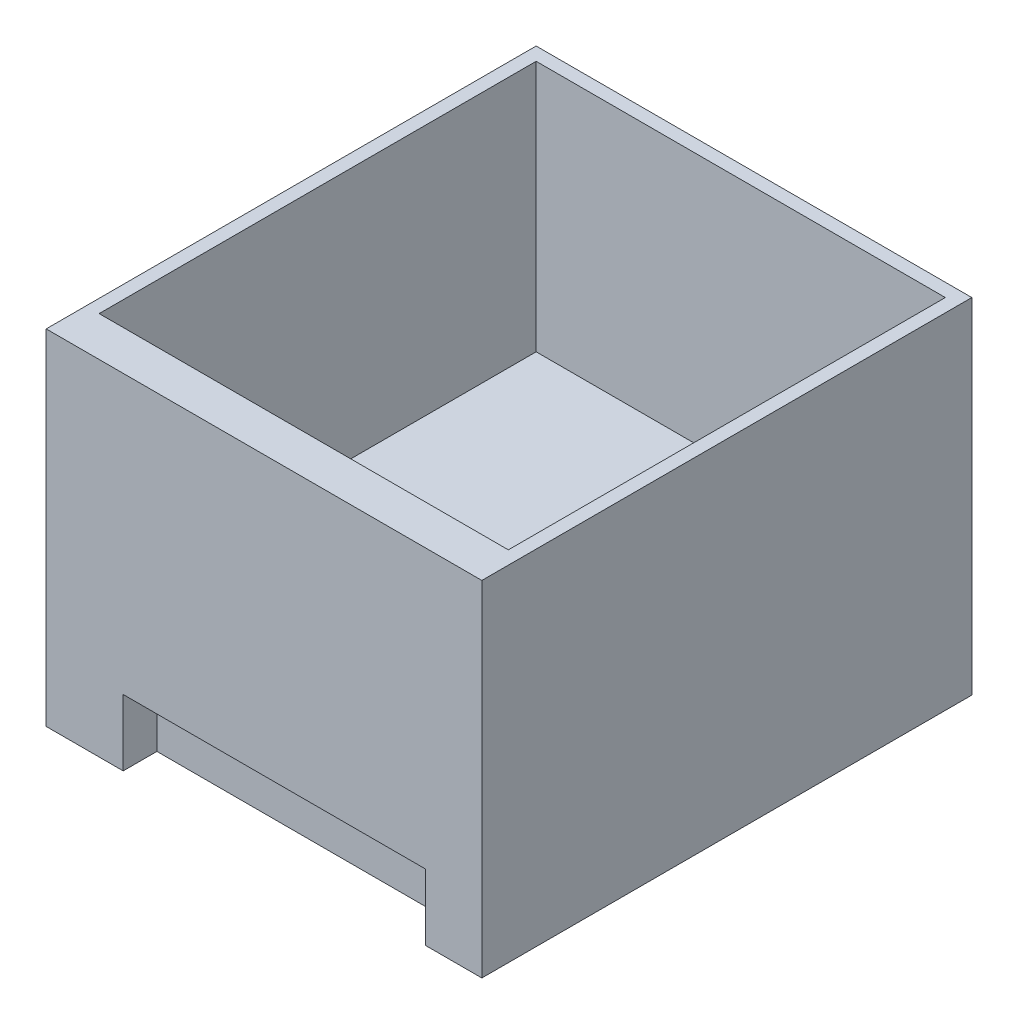
ISO-10303-21;
HEADER;
FILE_DESCRIPTION(('STEP AP214'),'2;1');
FILE_NAME('part.step','',(''),(''),'','','');
FILE_SCHEMA(('AUTOMOTIVE_DESIGN { 1 0 10303 214 1 1 1 1 }'));
ENDSEC;
DATA;
#1=APPLICATION_CONTEXT('core data for automotive mechanical design processes');
#2=APPLICATION_PROTOCOL_DEFINITION('international standard','automotive_design',2000,#1);
#3=PRODUCT_CONTEXT('',#1,'mechanical');
#4=PRODUCT('Part','Part','',(#3));
#5=PRODUCT_RELATED_PRODUCT_CATEGORY('part','',(#4));
#6=PRODUCT_DEFINITION_FORMATION('','',#4);
#7=PRODUCT_DEFINITION_CONTEXT('part definition',#1,'design');
#8=PRODUCT_DEFINITION('design','',#6,#7);
#9=PRODUCT_DEFINITION_SHAPE('','',#8);
#10=(LENGTH_UNIT() NAMED_UNIT(*) SI_UNIT(.MILLI.,.METRE.));
#11=(NAMED_UNIT(*) PLANE_ANGLE_UNIT() SI_UNIT($,.RADIAN.));
#12=(NAMED_UNIT(*) SI_UNIT($,.STERADIAN.) SOLID_ANGLE_UNIT());
#13=UNCERTAINTY_MEASURE_WITH_UNIT(LENGTH_MEASURE(1.E-05),#10,'distance_accuracy_value','');
#14=(GEOMETRIC_REPRESENTATION_CONTEXT(3) GLOBAL_UNCERTAINTY_ASSIGNED_CONTEXT((#13)) GLOBAL_UNIT_ASSIGNED_CONTEXT((#10,
#11,#12)) REPRESENTATION_CONTEXT('',''));
#15=CARTESIAN_POINT('',(0.,0.,0.));
#16=DIRECTION('',(0.,0.,1.));
#17=DIRECTION('',(1.,0.,0.));
#18=AXIS2_PLACEMENT_3D('',#15,#16,#17);
#19=CARTESIAN_POINT('',(-98.771737374825,47.4800796812749,-370.));
#20=DIRECTION('',(-1.,0.,0.));
#21=DIRECTION('',(0.,-1.,0.));
#22=AXIS2_PLACEMENT_3D('',#19,#20,#21);
#23=PLANE('',#22);
#24=DIRECTION('',(0.,-1.,0.));
#25=VECTOR('',#24,1.);
#26=CARTESIAN_POINT('',(-98.771737374825,47.4800796812749,0.));
#27=LINE('',#26,#25);
#28=CARTESIAN_POINT('',(-98.771737374825,47.4800796812749,0.));
#29=VERTEX_POINT('',#28);
#30=CARTESIAN_POINT('',(-98.771737374825,-212.519920318725,0.));
#31=VERTEX_POINT('',#30);
#32=EDGE_CURVE('E186',#29,#31,#27,.T.);
#33=ORIENTED_EDGE('',*,*,#32,.F.);
#34=DIRECTION('',(0.,0.,1.));
#35=VECTOR('',#34,1.);
#36=CARTESIAN_POINT('',(-98.771737374825,47.4800796812749,-370.));
#37=LINE('',#36,#35);
#38=CARTESIAN_POINT('',(-98.771737374825,47.4800796812749,-370.));
#39=VERTEX_POINT('',#38);
#40=EDGE_CURVE('E11',#39,#29,#37,.T.);
#41=ORIENTED_EDGE('',*,*,#40,.F.);
#42=DIRECTION('',(0.,-1.,0.));
#43=VECTOR('',#42,1.);
#44=CARTESIAN_POINT('',(-98.771737374825,47.4800796812749,-370.));
#45=LINE('',#44,#43);
#46=CARTESIAN_POINT('',(-98.771737374825,-212.519920318725,-370.));
#47=VERTEX_POINT('',#46);
#48=EDGE_CURVE('E192',#39,#47,#45,.T.);
#49=ORIENTED_EDGE('',*,*,#48,.T.);
#50=DIRECTION('',(0.,0.,1.));
#51=VECTOR('',#50,1.);
#52=CARTESIAN_POINT('',(-98.771737374825,-212.519920318725,-370.));
#53=LINE('',#52,#51);
#54=EDGE_CURVE('E40',#47,#31,#53,.T.);
#55=ORIENTED_EDGE('',*,*,#54,.T.);
#56=EDGE_LOOP('',(#33,#41,#49,#55));
#57=FACE_BOUND('',#56,.T.);
#58=ADVANCED_FACE('F37',(#57),#23,.T.);
#59=CARTESIAN_POINT('',(-98.771737374825,47.4800796812749,-370.));
#60=DIRECTION('',(0.,1.,0.));
#61=DIRECTION('',(0.,0.,1.));
#62=AXIS2_PLACEMENT_3D('',#59,#60,#61);
#63=PLANE('',#62);
#64=DIRECTION('',(0.,0.,-1.));
#65=VECTOR('',#64,1.);
#66=CARTESIAN_POINT('',(220.228262625175,47.4800796812749,-30.));
#67=LINE('',#66,#65);
#68=CARTESIAN_POINT('',(220.228262625175,47.4800796812749,-30.));
#69=VERTEX_POINT('',#68);
#70=CARTESIAN_POINT('',(220.228262625175,47.4800796812749,-360.));
#71=VERTEX_POINT('',#70);
#72=EDGE_CURVE('E61',#69,#71,#67,.T.);
#73=ORIENTED_EDGE('',*,*,#72,.F.);
#74=DIRECTION('',(1.,0.,0.));
#75=VECTOR('',#74,1.);
#76=CARTESIAN_POINT('',(220.228262625175,47.4800796812749,-30.));
#77=LINE('',#76,#75);
#78=CARTESIAN_POINT('',(-88.771737374825,47.4800796812749,-30.));
#79=VERTEX_POINT('',#78);
#80=EDGE_CURVE('E165',#79,#69,#77,.T.);
#81=ORIENTED_EDGE('',*,*,#80,.F.);
#82=DIRECTION('',(0.,0.,1.));
#83=VECTOR('',#82,1.);
#84=CARTESIAN_POINT('',(-88.771737374825,47.4800796812749,-30.));
#85=LINE('',#84,#83);
#86=CARTESIAN_POINT('',(-88.771737374825,47.4800796812749,-360.));
#87=VERTEX_POINT('',#86);
#88=EDGE_CURVE('E179',#87,#79,#85,.T.);
#89=ORIENTED_EDGE('',*,*,#88,.F.);
#90=DIRECTION('',(-1.,0.,0.));
#91=VECTOR('',#90,1.);
#92=CARTESIAN_POINT('',(220.228262625175,47.4800796812749,-360.));
#93=LINE('',#92,#91);
#94=EDGE_CURVE('E176',#71,#87,#93,.T.);
#95=ORIENTED_EDGE('',*,*,#94,.F.);
#96=EDGE_LOOP('',(#73,#81,#89,#95));
#97=FACE_BOUND('',#96,.T.);
#98=DIRECTION('',(-1.,0.,0.));
#99=VECTOR('',#98,1.);
#100=CARTESIAN_POINT('',(-98.771737374825,47.4800796812749,0.));
#101=LINE('',#100,#99);
#102=CARTESIAN_POINT('',(230.228262625175,47.4800796812749,0.));
#103=VERTEX_POINT('',#102);
#104=EDGE_CURVE('E196',#103,#29,#101,.T.);
#105=ORIENTED_EDGE('',*,*,#104,.F.);
#106=DIRECTION('',(0.,0.,1.));
#107=VECTOR('',#106,1.);
#108=CARTESIAN_POINT('',(230.228262625175,47.4800796812749,-370.));
#109=LINE('',#108,#107);
#110=CARTESIAN_POINT('',(230.228262625175,47.4800796812749,-370.));
#111=VERTEX_POINT('',#110);
#112=EDGE_CURVE('E45',#111,#103,#109,.T.);
#113=ORIENTED_EDGE('',*,*,#112,.F.);
#114=DIRECTION('',(-1.,0.,0.));
#115=VECTOR('',#114,1.);
#116=CARTESIAN_POINT('',(-98.771737374825,47.4800796812749,-370.));
#117=LINE('',#116,#115);
#118=EDGE_CURVE('E202',#111,#39,#117,.T.);
#119=ORIENTED_EDGE('',*,*,#118,.T.);
#120=ORIENTED_EDGE('',*,*,#40,.T.);
#121=EDGE_LOOP('',(#105,#113,#119,#120));
#122=FACE_BOUND('',#121,.T.);
#123=ADVANCED_FACE('F231',(#97,#122),#63,.T.);
#124=CARTESIAN_POINT('',(230.228262625175,47.4800796812749,-370.));
#125=DIRECTION('',(1.,0.,0.));
#126=DIRECTION('',(0.,1.,0.));
#127=AXIS2_PLACEMENT_3D('',#124,#125,#126);
#128=PLANE('',#127);
#129=DIRECTION('',(0.,1.,0.));
#130=VECTOR('',#129,1.);
#131=CARTESIAN_POINT('',(230.228262625175,47.4800796812749,0.));
#132=LINE('',#131,#130);
#133=CARTESIAN_POINT('',(230.228262625175,-212.519920318725,0.));
#134=VERTEX_POINT('',#133);
#135=EDGE_CURVE('E211',#134,#103,#132,.T.);
#136=ORIENTED_EDGE('',*,*,#135,.F.);
#137=DIRECTION('',(0.,0.,1.));
#138=VECTOR('',#137,1.);
#139=CARTESIAN_POINT('',(230.228262625175,-212.519920318725,-370.));
#140=LINE('',#139,#138);
#141=CARTESIAN_POINT('',(230.228262625175,-212.519920318725,-370.));
#142=VERTEX_POINT('',#141);
#143=EDGE_CURVE('E216',#142,#134,#140,.T.);
#144=ORIENTED_EDGE('',*,*,#143,.F.);
#145=DIRECTION('',(0.,1.,0.));
#146=VECTOR('',#145,1.);
#147=CARTESIAN_POINT('',(230.228262625175,47.4800796812749,-370.));
#148=LINE('',#147,#146);
#149=EDGE_CURVE('E199',#142,#111,#148,.T.);
#150=ORIENTED_EDGE('',*,*,#149,.T.);
#151=ORIENTED_EDGE('',*,*,#112,.T.);
#152=EDGE_LOOP('',(#136,#144,#150,#151));
#153=FACE_BOUND('',#152,.T.);
#154=ADVANCED_FACE('F237',(#153),#128,.T.);
#155=CARTESIAN_POINT('',(-98.771737374825,-212.519920318725,-370.));
#156=DIRECTION('',(0.,-1.,0.));
#157=DIRECTION('',(0.,0.,-1.));
#158=AXIS2_PLACEMENT_3D('',#155,#156,#157);
#159=PLANE('',#158);
#160=DIRECTION('',(0.,0.,-1.));
#161=VECTOR('',#160,1.);
#162=CARTESIAN_POINT('',(-40.6244894461179,-212.519920318725,0.));
#163=LINE('',#162,#161);
#164=CARTESIAN_POINT('',(-40.6244894461179,-212.519920318725,0.));
#165=VERTEX_POINT('',#164);
#166=CARTESIAN_POINT('',(-40.6244894461179,-212.519920318725,-25.4708718930602));
#167=VERTEX_POINT('',#166);
#168=EDGE_CURVE('E133',#165,#167,#163,.T.);
#169=ORIENTED_EDGE('',*,*,#168,.F.);
#170=DIRECTION('',(1.,0.,0.));
#171=VECTOR('',#170,1.);
#172=CARTESIAN_POINT('',(-98.771737374825,-212.519920318725,0.));
#173=LINE('',#172,#171);
#174=EDGE_CURVE('E208',#31,#165,#173,.T.);
#175=ORIENTED_EDGE('',*,*,#174,.F.);
#176=ORIENTED_EDGE('',*,*,#54,.F.);
#177=DIRECTION('',(1.,0.,0.));
#178=VECTOR('',#177,1.);
#179=CARTESIAN_POINT('',(-98.771737374825,-212.519920318725,-370.));
#180=LINE('',#179,#178);
#181=EDGE_CURVE('E195',#47,#142,#180,.T.);
#182=ORIENTED_EDGE('',*,*,#181,.T.);
#183=ORIENTED_EDGE('',*,*,#143,.T.);
#184=CARTESIAN_POINT('',(187.855824812306,-212.519920318725,0.));
#185=VERTEX_POINT('',#184);
#186=EDGE_CURVE('E207',#185,#134,#173,.T.);
#187=ORIENTED_EDGE('',*,*,#186,.F.);
#188=DIRECTION('',(0.,0.,1.));
#189=VECTOR('',#188,1.);
#190=CARTESIAN_POINT('',(187.855824812306,-212.519920318725,0.));
#191=LINE('',#190,#189);
#192=CARTESIAN_POINT('',(187.855824812306,-212.519920318725,-25.4708718930602));
#193=VERTEX_POINT('',#192);
#194=EDGE_CURVE('E146',#193,#185,#191,.T.);
#195=ORIENTED_EDGE('',*,*,#194,.F.);
#196=DIRECTION('',(1.,0.,0.));
#197=VECTOR('',#196,1.);
#198=CARTESIAN_POINT('',(-40.6244894461179,-212.519920318725,-25.4708718930602));
#199=LINE('',#198,#197);
#200=EDGE_CURVE('E148',#167,#193,#199,.T.);
#201=ORIENTED_EDGE('',*,*,#200,.F.);
#202=EDGE_LOOP('',(#169,#175,#176,#182,#183,#187,#195,#201));
#203=FACE_BOUND('',#202,.T.);
#204=ADVANCED_FACE('F226',(#203),#159,.T.);
#205=CARTESIAN_POINT('',(0.,0.,-370.));
#206=DIRECTION('',(0.,0.,1.));
#207=DIRECTION('',(1.,0.,0.));
#208=AXIS2_PLACEMENT_3D('',#205,#206,#207);
#209=PLANE('',#208);
#210=ORIENTED_EDGE('',*,*,#48,.F.);
#211=ORIENTED_EDGE('',*,*,#118,.F.);
#212=ORIENTED_EDGE('',*,*,#149,.F.);
#213=ORIENTED_EDGE('',*,*,#181,.F.);
#214=EDGE_LOOP('',(#210,#211,#212,#213));
#215=FACE_BOUND('',#214,.T.);
#216=ADVANCED_FACE('F234',(#215),#209,.F.);
#217=CARTESIAN_POINT('',(0.,0.,0.));
#218=DIRECTION('',(0.,0.,1.));
#219=DIRECTION('',(1.,0.,0.));
#220=AXIS2_PLACEMENT_3D('',#217,#218,#219);
#221=PLANE('',#220);
#222=DIRECTION('',(0.,-1.,0.));
#223=VECTOR('',#222,1.);
#224=CARTESIAN_POINT('',(-40.6244894461179,-162.519920318725,0.));
#225=LINE('',#224,#223);
#226=CARTESIAN_POINT('',(-40.6244894461179,-162.519920318725,0.));
#227=VERTEX_POINT('',#226);
#228=EDGE_CURVE('E155',#227,#165,#225,.T.);
#229=ORIENTED_EDGE('',*,*,#228,.F.);
#230=DIRECTION('',(-1.,0.,0.));
#231=VECTOR('',#230,1.);
#232=CARTESIAN_POINT('',(-40.6244894461179,-162.519920318725,0.));
#233=LINE('',#232,#231);
#234=CARTESIAN_POINT('',(187.855824812306,-162.519920318725,0.));
#235=VERTEX_POINT('',#234);
#236=EDGE_CURVE('E138',#235,#227,#233,.T.);
#237=ORIENTED_EDGE('',*,*,#236,.F.);
#238=DIRECTION('',(0.,-1.,0.));
#239=VECTOR('',#238,1.);
#240=CARTESIAN_POINT('',(187.855824812306,-162.519920318725,0.));
#241=LINE('',#240,#239);
#242=EDGE_CURVE('E157',#235,#185,#241,.T.);
#243=ORIENTED_EDGE('',*,*,#242,.T.);
#244=ORIENTED_EDGE('',*,*,#186,.T.);
#245=ORIENTED_EDGE('',*,*,#135,.T.);
#246=ORIENTED_EDGE('',*,*,#104,.T.);
#247=ORIENTED_EDGE('',*,*,#32,.T.);
#248=ORIENTED_EDGE('',*,*,#174,.T.);
#249=EDGE_LOOP('',(#229,#237,#243,#244,#245,#246,#247,#248));
#250=FACE_BOUND('',#249,.T.);
#251=ADVANCED_FACE('F228',(#250),#221,.T.);
#252=CARTESIAN_POINT('',(220.228262625175,-142.519920318725,-30.));
#253=DIRECTION('',(1.,0.,0.));
#254=DIRECTION('',(0.,0.,-1.));
#255=AXIS2_PLACEMENT_3D('',#252,#253,#254);
#256=PLANE('',#255);
#257=ORIENTED_EDGE('',*,*,#72,.T.);
#258=DIRECTION('',(0.,1.,0.));
#259=VECTOR('',#258,1.);
#260=CARTESIAN_POINT('',(220.228262625175,-142.519920318725,-360.));
#261=LINE('',#260,#259);
#262=CARTESIAN_POINT('',(220.228262625175,-142.519920318725,-360.));
#263=VERTEX_POINT('',#262);
#264=EDGE_CURVE('E174',#263,#71,#261,.T.);
#265=ORIENTED_EDGE('',*,*,#264,.F.);
#266=DIRECTION('',(0.,0.,-1.));
#267=VECTOR('',#266,1.);
#268=CARTESIAN_POINT('',(220.228262625175,-142.519920318725,-30.));
#269=LINE('',#268,#267);
#270=CARTESIAN_POINT('',(220.228262625175,-142.519920318725,-30.));
#271=VERTEX_POINT('',#270);
#272=EDGE_CURVE('E161',#271,#263,#269,.T.);
#273=ORIENTED_EDGE('',*,*,#272,.F.);
#274=DIRECTION('',(0.,1.,0.));
#275=VECTOR('',#274,1.);
#276=CARTESIAN_POINT('',(220.228262625175,-142.519920318725,-30.));
#277=LINE('',#276,#275);
#278=EDGE_CURVE('E184',#271,#69,#277,.T.);
#279=ORIENTED_EDGE('',*,*,#278,.T.);
#280=EDGE_LOOP('',(#257,#265,#273,#279));
#281=FACE_BOUND('',#280,.T.);
#282=ADVANCED_FACE('F263',(#281),#256,.F.);
#283=CARTESIAN_POINT('',(220.228262625175,-142.519920318725,-30.));
#284=DIRECTION('',(0.,0.,1.));
#285=DIRECTION('',(1.,0.,0.));
#286=AXIS2_PLACEMENT_3D('',#283,#284,#285);
#287=PLANE('',#286);
#288=ORIENTED_EDGE('',*,*,#80,.T.);
#289=ORIENTED_EDGE('',*,*,#278,.F.);
#290=DIRECTION('',(1.,0.,0.));
#291=VECTOR('',#290,1.);
#292=CARTESIAN_POINT('',(220.228262625175,-142.519920318725,-30.));
#293=LINE('',#292,#291);
#294=CARTESIAN_POINT('',(-88.771737374825,-142.519920318725,-30.));
#295=VERTEX_POINT('',#294);
#296=EDGE_CURVE('E171',#295,#271,#293,.T.);
#297=ORIENTED_EDGE('',*,*,#296,.F.);
#298=DIRECTION('',(0.,1.,0.));
#299=VECTOR('',#298,1.);
#300=CARTESIAN_POINT('',(-88.771737374825,-142.519920318725,-30.));
#301=LINE('',#300,#299);
#302=EDGE_CURVE('E187',#295,#79,#301,.T.);
#303=ORIENTED_EDGE('',*,*,#302,.T.);
#304=EDGE_LOOP('',(#288,#289,#297,#303));
#305=FACE_BOUND('',#304,.T.);
#306=ADVANCED_FACE('F268',(#305),#287,.F.);
#307=CARTESIAN_POINT('',(-88.771737374825,-142.519920318725,-30.));
#308=DIRECTION('',(-1.,0.,0.));
#309=DIRECTION('',(0.,0.,1.));
#310=AXIS2_PLACEMENT_3D('',#307,#308,#309);
#311=PLANE('',#310);
#312=ORIENTED_EDGE('',*,*,#88,.T.);
#313=ORIENTED_EDGE('',*,*,#302,.F.);
#314=DIRECTION('',(0.,0.,1.));
#315=VECTOR('',#314,1.);
#316=CARTESIAN_POINT('',(-88.771737374825,-142.519920318725,-30.));
#317=LINE('',#316,#315);
#318=CARTESIAN_POINT('',(-88.771737374825,-142.519920318725,-360.));
#319=VERTEX_POINT('',#318);
#320=EDGE_CURVE('E168',#319,#295,#317,.T.);
#321=ORIENTED_EDGE('',*,*,#320,.F.);
#322=DIRECTION('',(0.,1.,0.));
#323=VECTOR('',#322,1.);
#324=CARTESIAN_POINT('',(-88.771737374825,-142.519920318725,-360.));
#325=LINE('',#324,#323);
#326=EDGE_CURVE('E189',#319,#87,#325,.T.);
#327=ORIENTED_EDGE('',*,*,#326,.T.);
#328=EDGE_LOOP('',(#312,#313,#321,#327));
#329=FACE_BOUND('',#328,.T.);
#330=ADVANCED_FACE('F279',(#329),#311,.F.);
#331=CARTESIAN_POINT('',(220.228262625175,-142.519920318725,-360.));
#332=DIRECTION('',(0.,0.,-1.));
#333=DIRECTION('',(-1.,0.,0.));
#334=AXIS2_PLACEMENT_3D('',#331,#332,#333);
#335=PLANE('',#334);
#336=ORIENTED_EDGE('',*,*,#94,.T.);
#337=ORIENTED_EDGE('',*,*,#326,.F.);
#338=DIRECTION('',(-1.,0.,0.));
#339=VECTOR('',#338,1.);
#340=CARTESIAN_POINT('',(220.228262625175,-142.519920318725,-360.));
#341=LINE('',#340,#339);
#342=EDGE_CURVE('E164',#263,#319,#341,.T.);
#343=ORIENTED_EDGE('',*,*,#342,.F.);
#344=ORIENTED_EDGE('',*,*,#264,.T.);
#345=EDGE_LOOP('',(#336,#337,#343,#344));
#346=FACE_BOUND('',#345,.T.);
#347=ADVANCED_FACE('F289',(#346),#335,.F.);
#348=CARTESIAN_POINT('',(0.,-142.519920318725,0.));
#349=DIRECTION('',(0.,1.,0.));
#350=DIRECTION('',(0.,0.,1.));
#351=AXIS2_PLACEMENT_3D('',#348,#349,#350);
#352=PLANE('',#351);
#353=ORIENTED_EDGE('',*,*,#272,.T.);
#354=ORIENTED_EDGE('',*,*,#342,.T.);
#355=ORIENTED_EDGE('',*,*,#320,.T.);
#356=ORIENTED_EDGE('',*,*,#296,.T.);
#357=EDGE_LOOP('',(#353,#354,#355,#356));
#358=FACE_BOUND('',#357,.T.);
#359=ADVANCED_FACE('F299',(#358),#352,.T.);
#360=CARTESIAN_POINT('',(-40.6244894461179,-162.519920318725,0.));
#361=DIRECTION('',(-1.,0.,0.));
#362=DIRECTION('',(0.,0.,1.));
#363=AXIS2_PLACEMENT_3D('',#360,#361,#362);
#364=PLANE('',#363);
#365=ORIENTED_EDGE('',*,*,#168,.T.);
#366=DIRECTION('',(0.,-1.,0.));
#367=VECTOR('',#366,1.);
#368=CARTESIAN_POINT('',(-40.6244894461179,-162.519920318725,-25.4708718930602));
#369=LINE('',#368,#367);
#370=CARTESIAN_POINT('',(-40.6244894461179,-162.519920318725,-25.4708718930602));
#371=VERTEX_POINT('',#370);
#372=EDGE_CURVE('E127',#371,#167,#369,.T.);
#373=ORIENTED_EDGE('',*,*,#372,.F.);
#374=DIRECTION('',(0.,0.,-1.));
#375=VECTOR('',#374,1.);
#376=CARTESIAN_POINT('',(-40.6244894461179,-162.519920318725,0.));
#377=LINE('',#376,#375);
#378=EDGE_CURVE('E131',#227,#371,#377,.T.);
#379=ORIENTED_EDGE('',*,*,#378,.F.);
#380=ORIENTED_EDGE('',*,*,#228,.T.);
#381=EDGE_LOOP('',(#365,#373,#379,#380));
#382=FACE_BOUND('',#381,.T.);
#383=ADVANCED_FACE('F129',(#382),#364,.F.);
#384=CARTESIAN_POINT('',(187.855824812306,-162.519920318725,0.));
#385=DIRECTION('',(1.,0.,0.));
#386=DIRECTION('',(0.,0.,-1.));
#387=AXIS2_PLACEMENT_3D('',#384,#385,#386);
#388=PLANE('',#387);
#389=ORIENTED_EDGE('',*,*,#194,.T.);
#390=ORIENTED_EDGE('',*,*,#242,.F.);
#391=DIRECTION('',(0.,0.,1.));
#392=VECTOR('',#391,1.);
#393=CARTESIAN_POINT('',(187.855824812306,-162.519920318725,0.));
#394=LINE('',#393,#392);
#395=CARTESIAN_POINT('',(187.855824812306,-162.519920318725,-25.4708718930602));
#396=VERTEX_POINT('',#395);
#397=EDGE_CURVE('E53',#396,#235,#394,.T.);
#398=ORIENTED_EDGE('',*,*,#397,.F.);
#399=DIRECTION('',(0.,-1.,0.));
#400=VECTOR('',#399,1.);
#401=CARTESIAN_POINT('',(187.855824812306,-162.519920318725,-25.4708718930602));
#402=LINE('',#401,#400);
#403=EDGE_CURVE('E137',#396,#193,#402,.T.);
#404=ORIENTED_EDGE('',*,*,#403,.T.);
#405=EDGE_LOOP('',(#389,#390,#398,#404));
#406=FACE_BOUND('',#405,.T.);
#407=ADVANCED_FACE('F330',(#406),#388,.F.);
#408=CARTESIAN_POINT('',(-40.6244894461179,-162.519920318725,-25.4708718930602));
#409=DIRECTION('',(0.,0.,-1.));
#410=DIRECTION('',(-1.,0.,0.));
#411=AXIS2_PLACEMENT_3D('',#408,#409,#410);
#412=PLANE('',#411);
#413=ORIENTED_EDGE('',*,*,#200,.T.);
#414=ORIENTED_EDGE('',*,*,#403,.F.);
#415=DIRECTION('',(1.,0.,0.));
#416=VECTOR('',#415,1.);
#417=CARTESIAN_POINT('',(-40.6244894461179,-162.519920318725,-25.4708718930602));
#418=LINE('',#417,#416);
#419=EDGE_CURVE('E140',#371,#396,#418,.T.);
#420=ORIENTED_EDGE('',*,*,#419,.F.);
#421=ORIENTED_EDGE('',*,*,#372,.T.);
#422=EDGE_LOOP('',(#413,#414,#420,#421));
#423=FACE_BOUND('',#422,.T.);
#424=ADVANCED_FACE('F141',(#423),#412,.F.);
#425=CARTESIAN_POINT('',(0.,-162.519920318725,0.));
#426=DIRECTION('',(0.,-1.,0.));
#427=DIRECTION('',(0.,0.,-1.));
#428=AXIS2_PLACEMENT_3D('',#425,#426,#427);
#429=PLANE('',#428);
#430=ORIENTED_EDGE('',*,*,#378,.T.);
#431=ORIENTED_EDGE('',*,*,#419,.T.);
#432=ORIENTED_EDGE('',*,*,#397,.T.);
#433=ORIENTED_EDGE('',*,*,#236,.T.);
#434=EDGE_LOOP('',(#430,#431,#432,#433));
#435=FACE_BOUND('',#434,.T.);
#436=ADVANCED_FACE('F143',(#435),#429,.T.);
#437=CLOSED_SHELL('',(#58,#123,#154,#204,#216,#251,#282,#306,#330,#347,#359,#383,#407,#424,#436));
#438=MANIFOLD_SOLID_BREP('B2',#437);
#439=ADVANCED_BREP_SHAPE_REPRESENTATION('',(#18,#438),#14);
#440=SHAPE_DEFINITION_REPRESENTATION(#9,#439);
ENDSEC;
END-ISO-10303-21;
